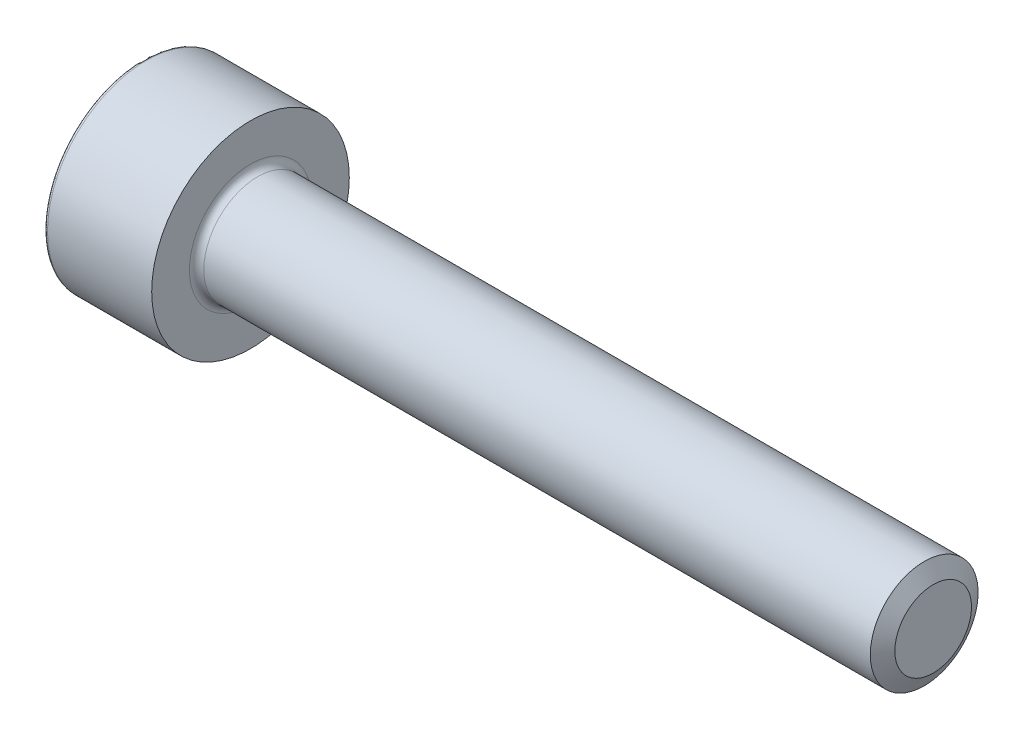
ISO-10303-21;
HEADER;
FILE_DESCRIPTION(('STEP AP214'),'2;1');
FILE_NAME('part.step','',(''),(''),'','','');
FILE_SCHEMA(('AUTOMOTIVE_DESIGN { 1 0 10303 214 1 1 1 1 }'));
ENDSEC;
DATA;
#1=APPLICATION_CONTEXT('core data for automotive mechanical design processes');
#2=APPLICATION_PROTOCOL_DEFINITION('international standard','automotive_design',2000,#1);
#3=PRODUCT_CONTEXT('',#1,'mechanical');
#4=PRODUCT('Part','Part','',(#3));
#5=PRODUCT_RELATED_PRODUCT_CATEGORY('part','',(#4));
#6=PRODUCT_DEFINITION_FORMATION('','',#4);
#7=PRODUCT_DEFINITION_CONTEXT('part definition',#1,'design');
#8=PRODUCT_DEFINITION('design','',#6,#7);
#9=PRODUCT_DEFINITION_SHAPE('','',#8);
#10=(LENGTH_UNIT() NAMED_UNIT(*) SI_UNIT(.MILLI.,.METRE.));
#11=(NAMED_UNIT(*) PLANE_ANGLE_UNIT() SI_UNIT($,.RADIAN.));
#12=(NAMED_UNIT(*) SI_UNIT($,.STERADIAN.) SOLID_ANGLE_UNIT());
#13=UNCERTAINTY_MEASURE_WITH_UNIT(LENGTH_MEASURE(1.E-05),#10,'distance_accuracy_value','');
#14=(GEOMETRIC_REPRESENTATION_CONTEXT(3) GLOBAL_UNCERTAINTY_ASSIGNED_CONTEXT((#13)) GLOBAL_UNIT_ASSIGNED_CONTEXT((#10,
#11,#12)) REPRESENTATION_CONTEXT('',''));
#15=CARTESIAN_POINT('',(0.,0.,0.));
#16=DIRECTION('',(0.,0.,1.));
#17=DIRECTION('',(1.,0.,0.));
#18=AXIS2_PLACEMENT_3D('',#15,#16,#17);
#19=CARTESIAN_POINT('',(0.,0.,0.));
#20=DIRECTION('',(-1.,0.,0.));
#21=DIRECTION('',(0.,0.,1.));
#22=AXIS2_PLACEMENT_3D('',#19,#20,#21);
#23=CYLINDRICAL_SURFACE('',#22,1.5);
#24=CARTESIAN_POINT('',(3.2,0.,0.));
#25=DIRECTION('',(-1.,0.,0.));
#26=DIRECTION('',(0.,0.,1.));
#27=AXIS2_PLACEMENT_3D('',#24,#25,#26);
#28=CIRCLE('',#27,1.5);
#29=CARTESIAN_POINT('',(3.2,0.,1.5));
#30=VERTEX_POINT('',#29);
#31=EDGE_CURVE('E152',#30,#30,#28,.T.);
#32=ORIENTED_EDGE('',*,*,#31,.F.);
#33=EDGE_LOOP('',(#32));
#34=FACE_BOUND('',#33,.T.);
#35=CARTESIAN_POINT('',(21.7500073334409,0.,0.));
#36=DIRECTION('',(-1.,0.,0.));
#37=DIRECTION('',(0.,0.,1.));
#38=AXIS2_PLACEMENT_3D('',#35,#36,#37);
#39=CIRCLE('',#38,1.5);
#40=CARTESIAN_POINT('',(21.7500073334409,0.,1.5));
#41=VERTEX_POINT('',#40);
#42=EDGE_CURVE('E306',#41,#41,#39,.T.);
#43=ORIENTED_EDGE('',*,*,#42,.T.);
#44=EDGE_LOOP('',(#43));
#45=FACE_BOUND('',#44,.T.);
#46=ADVANCED_FACE('F49',(#34,#45),#23,.T.);
#47=CARTESIAN_POINT('',(0.,0.,0.));
#48=DIRECTION('',(1.,0.,0.));
#49=DIRECTION('',(0.,0.,-1.));
#50=AXIS2_PLACEMENT_3D('',#47,#48,#49);
#51=PLANE('',#50);
#52=CARTESIAN_POINT('',(0.,0.,0.));
#53=DIRECTION('',(1.,0.,0.));
#54=DIRECTION('',(0.,0.,-1.));
#55=AXIS2_PLACEMENT_3D('',#52,#53,#54);
#56=CIRCLE('',#55,2.65);
#57=CARTESIAN_POINT('',(0.,0.,-2.65));
#58=VERTEX_POINT('',#57);
#59=EDGE_CURVE('E57',#58,#58,#56,.F.);
#60=ORIENTED_EDGE('',*,*,#59,.T.);
#61=EDGE_LOOP('',(#60));
#62=FACE_BOUND('',#61,.T.);
#63=DIRECTION('',(0.,0.866025403784439,-0.5));
#64=VECTOR('',#63,1.);
#65=CARTESIAN_POINT('',(0.,0.,1.435));
#66=LINE('',#65,#64);
#67=CARTESIAN_POINT('',(0.,0.,1.435));
#68=VERTEX_POINT('',#67);
#69=CARTESIAN_POINT('',(0.,1.24274645443067,0.717499999999999));
#70=VERTEX_POINT('',#69);
#71=EDGE_CURVE('E138',#68,#70,#66,.T.);
#72=ORIENTED_EDGE('',*,*,#71,.F.);
#73=DIRECTION('',(0.,0.866025403784439,0.5));
#74=VECTOR('',#73,1.);
#75=CARTESIAN_POINT('',(0.,-1.24274645443067,0.7175));
#76=LINE('',#75,#74);
#77=CARTESIAN_POINT('',(0.,-1.24274645443067,0.7175));
#78=VERTEX_POINT('',#77);
#79=EDGE_CURVE('E64',#78,#68,#76,.T.);
#80=ORIENTED_EDGE('',*,*,#79,.F.);
#81=DIRECTION('',(0.,0.,1.));
#82=VECTOR('',#81,1.);
#83=CARTESIAN_POINT('',(0.,-1.24274645443067,-0.7175));
#84=LINE('',#83,#82);
#85=CARTESIAN_POINT('',(0.,-1.24274645443067,-0.7175));
#86=VERTEX_POINT('',#85);
#87=EDGE_CURVE('E148',#86,#78,#84,.T.);
#88=ORIENTED_EDGE('',*,*,#87,.F.);
#89=DIRECTION('',(0.,-0.866025403784439,0.5));
#90=VECTOR('',#89,1.);
#91=CARTESIAN_POINT('',(0.,0.,-1.435));
#92=LINE('',#91,#90);
#93=CARTESIAN_POINT('',(0.,0.,-1.435));
#94=VERTEX_POINT('',#93);
#95=EDGE_CURVE('E146',#94,#86,#92,.T.);
#96=ORIENTED_EDGE('',*,*,#95,.F.);
#97=DIRECTION('',(0.,-0.866025403784439,-0.5));
#98=VECTOR('',#97,1.);
#99=CARTESIAN_POINT('',(0.,1.24274645443067,-0.7175));
#100=LINE('',#99,#98);
#101=CARTESIAN_POINT('',(0.,1.24274645443067,-0.7175));
#102=VERTEX_POINT('',#101);
#103=EDGE_CURVE('E112',#102,#94,#100,.T.);
#104=ORIENTED_EDGE('',*,*,#103,.F.);
#105=DIRECTION('',(0.,0.,-1.));
#106=VECTOR('',#105,1.);
#107=CARTESIAN_POINT('',(0.,1.24274645443067,0.717499999999999));
#108=LINE('',#107,#106);
#109=EDGE_CURVE('E142',#70,#102,#108,.T.);
#110=ORIENTED_EDGE('',*,*,#109,.F.);
#111=EDGE_LOOP('',(#72,#80,#88,#96,#104,#110));
#112=FACE_BOUND('',#111,.T.);
#113=ADVANCED_FACE('F169',(#62,#112),#51,.F.);
#114=CARTESIAN_POINT('',(0.,0.,0.));
#115=DIRECTION('',(-1.,0.,0.));
#116=DIRECTION('',(0.,0.,1.));
#117=AXIS2_PLACEMENT_3D('',#114,#115,#116);
#118=CYLINDRICAL_SURFACE('',#117,2.75);
#119=CARTESIAN_POINT('',(0.1,0.,0.));
#120=DIRECTION('',(1.,0.,0.));
#121=DIRECTION('',(0.,0.,-1.));
#122=AXIS2_PLACEMENT_3D('',#119,#120,#121);
#123=CIRCLE('',#122,2.75);
#124=CARTESIAN_POINT('',(0.1,0.,-2.75));
#125=VERTEX_POINT('',#124);
#126=EDGE_CURVE('E11',#125,#125,#123,.T.);
#127=ORIENTED_EDGE('',*,*,#126,.T.);
#128=EDGE_LOOP('',(#127));
#129=FACE_BOUND('',#128,.T.);
#130=CARTESIAN_POINT('',(3.,0.,0.));
#131=DIRECTION('',(-1.,0.,0.));
#132=DIRECTION('',(0.,0.,1.));
#133=AXIS2_PLACEMENT_3D('',#130,#131,#132);
#134=CIRCLE('',#133,2.75);
#135=CARTESIAN_POINT('',(3.,0.,2.75));
#136=VERTEX_POINT('',#135);
#137=EDGE_CURVE('E163',#136,#136,#134,.T.);
#138=ORIENTED_EDGE('',*,*,#137,.T.);
#139=EDGE_LOOP('',(#138));
#140=FACE_BOUND('',#139,.T.);
#141=ADVANCED_FACE('F189',(#129,#140),#118,.T.);
#142=CARTESIAN_POINT('',(3.,2.75,0.));
#143=DIRECTION('',(-1.,0.,0.));
#144=DIRECTION('',(0.,0.,1.));
#145=AXIS2_PLACEMENT_3D('',#142,#143,#144);
#146=PLANE('',#145);
#147=ORIENTED_EDGE('',*,*,#137,.F.);
#148=EDGE_LOOP('',(#147));
#149=FACE_BOUND('',#148,.T.);
#150=CARTESIAN_POINT('',(3.,0.,0.));
#151=DIRECTION('',(-1.,0.,0.));
#152=DIRECTION('',(0.,0.,1.));
#153=AXIS2_PLACEMENT_3D('',#150,#151,#152);
#154=CIRCLE('',#153,1.7);
#155=CARTESIAN_POINT('',(3.,0.,1.7));
#156=VERTEX_POINT('',#155);
#157=EDGE_CURVE('E160',#156,#156,#154,.T.);
#158=ORIENTED_EDGE('',*,*,#157,.T.);
#159=EDGE_LOOP('',(#158));
#160=FACE_BOUND('',#159,.T.);
#161=ADVANCED_FACE('F198',(#149,#160),#146,.F.);
#162=CARTESIAN_POINT('',(3.2,0.,0.));
#163=DIRECTION('',(-1.,0.,0.));
#164=DIRECTION('',(0.,0.,1.));
#165=AXIS2_PLACEMENT_3D('',#162,#163,#164);
#166=TOROIDAL_SURFACE('',#165,1.7,0.2);
#167=ORIENTED_EDGE('',*,*,#157,.F.);
#168=EDGE_LOOP('',(#167));
#169=FACE_BOUND('',#168,.T.);
#170=ORIENTED_EDGE('',*,*,#31,.T.);
#171=EDGE_LOOP('',(#170));
#172=FACE_BOUND('',#171,.T.);
#173=ADVANCED_FACE('F194',(#169,#172),#166,.F.);
#174=CARTESIAN_POINT('',(1.3,-1.24274645443067,0.7175));
#175=DIRECTION('',(0.,-0.5,0.866025403784439));
#176=DIRECTION('',(0.,-0.866025403784439,-0.5));
#177=AXIS2_PLACEMENT_3D('',#174,#175,#176);
#178=PLANE('',#177);
#179=ORIENTED_EDGE('',*,*,#79,.T.);
#180=DIRECTION('',(-1.,0.,0.));
#181=VECTOR('',#180,1.);
#182=CARTESIAN_POINT('',(1.3,0.,1.435));
#183=LINE('',#182,#181);
#184=CARTESIAN_POINT('',(1.3,0.,1.435));
#185=VERTEX_POINT('',#184);
#186=EDGE_CURVE('E94',#185,#68,#183,.T.);
#187=ORIENTED_EDGE('',*,*,#186,.F.);
#188=DIRECTION('',(0.,0.866025403784439,0.5));
#189=VECTOR('',#188,1.);
#190=CARTESIAN_POINT('',(1.3,-1.24274645443067,0.7175));
#191=LINE('',#190,#189);
#192=CARTESIAN_POINT('',(1.3,-1.24274645443067,0.7175));
#193=VERTEX_POINT('',#192);
#194=EDGE_CURVE('E150',#193,#185,#191,.T.);
#195=ORIENTED_EDGE('',*,*,#194,.F.);
#196=DIRECTION('',(-1.,0.,0.));
#197=VECTOR('',#196,1.);
#198=CARTESIAN_POINT('',(1.3,-1.24274645443067,0.7175));
#199=LINE('',#198,#197);
#200=EDGE_CURVE('E72',#193,#78,#199,.T.);
#201=ORIENTED_EDGE('',*,*,#200,.T.);
#202=EDGE_LOOP('',(#179,#187,#195,#201));
#203=FACE_BOUND('',#202,.T.);
#204=ADVANCED_FACE('F197',(#203),#178,.F.);
#205=CARTESIAN_POINT('',(1.3,-1.24274645443067,-0.7175));
#206=DIRECTION('',(0.,-1.,0.));
#207=DIRECTION('',(0.,0.,-1.));
#208=AXIS2_PLACEMENT_3D('',#205,#206,#207);
#209=PLANE('',#208);
#210=ORIENTED_EDGE('',*,*,#87,.T.);
#211=ORIENTED_EDGE('',*,*,#200,.F.);
#212=DIRECTION('',(0.,0.,1.));
#213=VECTOR('',#212,1.);
#214=CARTESIAN_POINT('',(1.3,-1.24274645443067,-0.7175));
#215=LINE('',#214,#213);
#216=CARTESIAN_POINT('',(1.3,-1.24274645443067,-0.7175));
#217=VERTEX_POINT('',#216);
#218=EDGE_CURVE('E124',#217,#193,#215,.T.);
#219=ORIENTED_EDGE('',*,*,#218,.F.);
#220=DIRECTION('',(-1.,0.,0.));
#221=VECTOR('',#220,1.);
#222=CARTESIAN_POINT('',(1.3,-1.24274645443067,-0.7175));
#223=LINE('',#222,#221);
#224=EDGE_CURVE('E116',#217,#86,#223,.T.);
#225=ORIENTED_EDGE('',*,*,#224,.T.);
#226=EDGE_LOOP('',(#210,#211,#219,#225));
#227=FACE_BOUND('',#226,.T.);
#228=ADVANCED_FACE('F271',(#227),#209,.F.);
#229=CARTESIAN_POINT('',(1.3,0.,-1.435));
#230=DIRECTION('',(0.,-0.5,-0.866025403784439));
#231=DIRECTION('',(0.,0.866025403784439,-0.5));
#232=AXIS2_PLACEMENT_3D('',#229,#230,#231);
#233=PLANE('',#232);
#234=ORIENTED_EDGE('',*,*,#95,.T.);
#235=ORIENTED_EDGE('',*,*,#224,.F.);
#236=DIRECTION('',(0.,-0.866025403784439,0.5));
#237=VECTOR('',#236,1.);
#238=CARTESIAN_POINT('',(1.3,0.,-1.435));
#239=LINE('',#238,#237);
#240=CARTESIAN_POINT('',(1.3,0.,-1.435));
#241=VERTEX_POINT('',#240);
#242=EDGE_CURVE('E120',#241,#217,#239,.T.);
#243=ORIENTED_EDGE('',*,*,#242,.F.);
#244=DIRECTION('',(-1.,0.,0.));
#245=VECTOR('',#244,1.);
#246=CARTESIAN_POINT('',(1.3,0.,-1.435));
#247=LINE('',#246,#245);
#248=EDGE_CURVE('E105',#241,#94,#247,.T.);
#249=ORIENTED_EDGE('',*,*,#248,.T.);
#250=EDGE_LOOP('',(#234,#235,#243,#249));
#251=FACE_BOUND('',#250,.T.);
#252=ADVANCED_FACE('F121',(#251),#233,.F.);
#253=CARTESIAN_POINT('',(1.3,1.24274645443067,-0.7175));
#254=DIRECTION('',(0.,0.5,-0.866025403784439));
#255=DIRECTION('',(0.,0.866025403784439,0.5));
#256=AXIS2_PLACEMENT_3D('',#253,#254,#255);
#257=PLANE('',#256);
#258=ORIENTED_EDGE('',*,*,#103,.T.);
#259=ORIENTED_EDGE('',*,*,#248,.F.);
#260=DIRECTION('',(0.,-0.866025403784439,-0.5));
#261=VECTOR('',#260,1.);
#262=CARTESIAN_POINT('',(1.3,1.24274645443067,-0.7175));
#263=LINE('',#262,#261);
#264=CARTESIAN_POINT('',(1.3,1.24274645443067,-0.7175));
#265=VERTEX_POINT('',#264);
#266=EDGE_CURVE('E109',#265,#241,#263,.T.);
#267=ORIENTED_EDGE('',*,*,#266,.F.);
#268=DIRECTION('',(-1.,0.,0.));
#269=VECTOR('',#268,1.);
#270=CARTESIAN_POINT('',(1.3,1.24274645443067,-0.7175));
#271=LINE('',#270,#269);
#272=EDGE_CURVE('E117',#265,#102,#271,.T.);
#273=ORIENTED_EDGE('',*,*,#272,.T.);
#274=EDGE_LOOP('',(#258,#259,#267,#273));
#275=FACE_BOUND('',#274,.T.);
#276=ADVANCED_FACE('F107',(#275),#257,.F.);
#277=CARTESIAN_POINT('',(1.3,1.24274645443067,0.717499999999999));
#278=DIRECTION('',(0.,1.,0.));
#279=DIRECTION('',(0.,0.,1.));
#280=AXIS2_PLACEMENT_3D('',#277,#278,#279);
#281=PLANE('',#280);
#282=ORIENTED_EDGE('',*,*,#109,.T.);
#283=ORIENTED_EDGE('',*,*,#272,.F.);
#284=DIRECTION('',(0.,0.,-1.));
#285=VECTOR('',#284,1.);
#286=CARTESIAN_POINT('',(1.3,1.24274645443067,0.717499999999999));
#287=LINE('',#286,#285);
#288=CARTESIAN_POINT('',(1.3,1.24274645443067,0.717499999999999));
#289=VERTEX_POINT('',#288);
#290=EDGE_CURVE('E130',#289,#265,#287,.T.);
#291=ORIENTED_EDGE('',*,*,#290,.F.);
#292=DIRECTION('',(-1.,0.,0.));
#293=VECTOR('',#292,1.);
#294=CARTESIAN_POINT('',(1.3,1.24274645443067,0.717499999999999));
#295=LINE('',#294,#293);
#296=EDGE_CURVE('E155',#289,#70,#295,.T.);
#297=ORIENTED_EDGE('',*,*,#296,.T.);
#298=EDGE_LOOP('',(#282,#283,#291,#297));
#299=FACE_BOUND('',#298,.T.);
#300=ADVANCED_FACE('F250',(#299),#281,.F.);
#301=CARTESIAN_POINT('',(1.3,0.,1.435));
#302=DIRECTION('',(0.,0.5,0.866025403784439));
#303=DIRECTION('',(0.,-0.866025403784439,0.5));
#304=AXIS2_PLACEMENT_3D('',#301,#302,#303);
#305=PLANE('',#304);
#306=ORIENTED_EDGE('',*,*,#71,.T.);
#307=ORIENTED_EDGE('',*,*,#296,.F.);
#308=DIRECTION('',(0.,0.866025403784439,-0.5));
#309=VECTOR('',#308,1.);
#310=CARTESIAN_POINT('',(1.3,0.,1.435));
#311=LINE('',#310,#309);
#312=EDGE_CURVE('E132',#185,#289,#311,.T.);
#313=ORIENTED_EDGE('',*,*,#312,.F.);
#314=ORIENTED_EDGE('',*,*,#186,.T.);
#315=EDGE_LOOP('',(#306,#307,#313,#314));
#316=FACE_BOUND('',#315,.T.);
#317=ADVANCED_FACE('F243',(#316),#305,.F.);
#318=CARTESIAN_POINT('',(1.3,-1.24274645443067,0.7175));
#319=DIRECTION('',(1.,0.,0.));
#320=DIRECTION('',(0.,0.,-1.));
#321=AXIS2_PLACEMENT_3D('',#318,#319,#320);
#322=PLANE('',#321);
#323=ORIENTED_EDGE('',*,*,#194,.T.);
#324=ORIENTED_EDGE('',*,*,#312,.T.);
#325=ORIENTED_EDGE('',*,*,#290,.T.);
#326=ORIENTED_EDGE('',*,*,#266,.T.);
#327=ORIENTED_EDGE('',*,*,#242,.T.);
#328=ORIENTED_EDGE('',*,*,#218,.T.);
#329=EDGE_LOOP('',(#323,#324,#325,#326,#327,#328));
#330=FACE_BOUND('',#329,.T.);
#331=ADVANCED_FACE('F127',(#330),#322,.F.);
#332=CARTESIAN_POINT('',(21.7500073334409,0.,0.));
#333=DIRECTION('',(-1.,0.,0.));
#334=DIRECTION('',(0.,0.,1.));
#335=AXIS2_PLACEMENT_3D('',#332,#333,#334);
#336=CONICAL_SURFACE('',#335,1.5,1.04719755119659);
#337=CARTESIAN_POINT('',(22.,0.,0.));
#338=DIRECTION('',(-1.,0.,0.));
#339=DIRECTION('',(0.,0.,1.));
#340=AXIS2_PLACEMENT_3D('',#337,#338,#339);
#341=CIRCLE('',#340,1.067);
#342=CARTESIAN_POINT('',(22.,0.,1.067));
#343=VERTEX_POINT('',#342);
#344=EDGE_CURVE('E139',#343,#343,#341,.T.);
#345=ORIENTED_EDGE('',*,*,#344,.T.);
#346=EDGE_LOOP('',(#345));
#347=FACE_BOUND('',#346,.T.);
#348=ORIENTED_EDGE('',*,*,#42,.F.);
#349=EDGE_LOOP('',(#348));
#350=FACE_BOUND('',#349,.T.);
#351=ADVANCED_FACE('F179',(#347,#350),#336,.T.);
#352=CARTESIAN_POINT('',(22.,1.5,0.));
#353=DIRECTION('',(-1.,0.,0.));
#354=DIRECTION('',(0.,0.,1.));
#355=AXIS2_PLACEMENT_3D('',#352,#353,#354);
#356=PLANE('',#355);
#357=ORIENTED_EDGE('',*,*,#344,.F.);
#358=EDGE_LOOP('',(#357));
#359=FACE_BOUND('',#358,.T.);
#360=ADVANCED_FACE('F173',(#359),#356,.F.);
#361=CARTESIAN_POINT('',(0.1,0.,0.));
#362=DIRECTION('',(1.,0.,0.));
#363=DIRECTION('',(0.,0.,-1.));
#364=AXIS2_PLACEMENT_3D('',#361,#362,#363);
#365=TOROIDAL_SURFACE('',#364,2.65,0.1);
#366=ORIENTED_EDGE('',*,*,#126,.F.);
#367=EDGE_LOOP('',(#366));
#368=FACE_BOUND('',#367,.T.);
#369=ORIENTED_EDGE('',*,*,#59,.F.);
#370=EDGE_LOOP('',(#369));
#371=FACE_BOUND('',#370,.T.);
#372=ADVANCED_FACE('F51',(#368,#371),#365,.T.);
#373=CLOSED_SHELL('',(#46,#113,#141,#161,#173,#204,#228,#252,#276,#300,#317,#331,#351,#360,#372));
#374=MANIFOLD_SOLID_BREP('B2',#373);
#375=ADVANCED_BREP_SHAPE_REPRESENTATION('',(#18,#374),#14);
#376=SHAPE_DEFINITION_REPRESENTATION(#9,#375);
ENDSEC;
END-ISO-10303-21;
